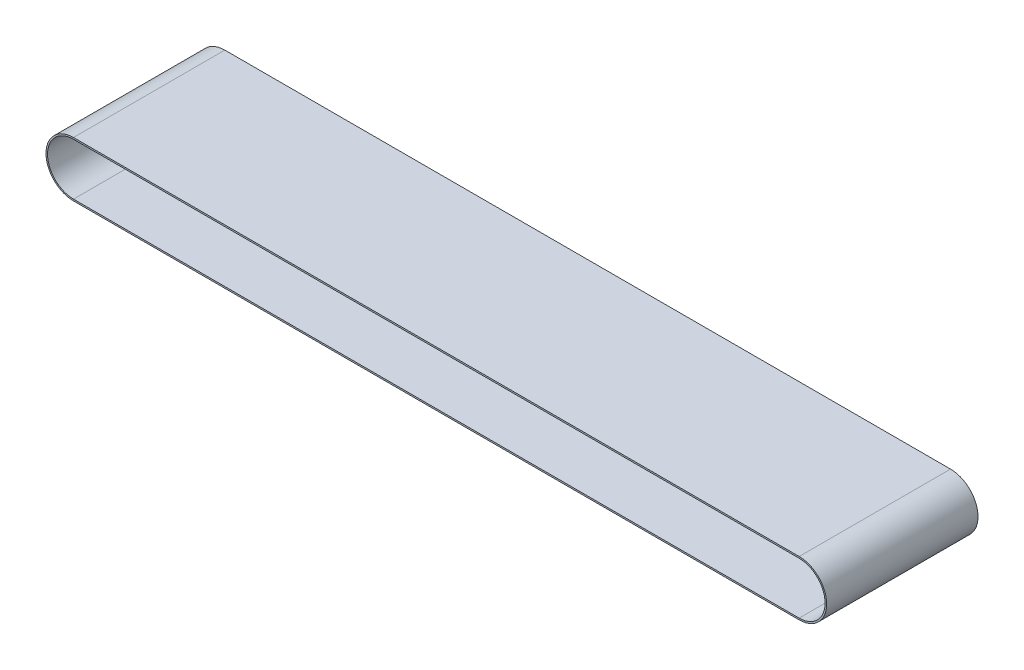
ISO-10303-21;
HEADER;
FILE_DESCRIPTION(('STEP AP214'),'2;1');
FILE_NAME('part.step','',(''),(''),'','','');
FILE_SCHEMA(('AUTOMOTIVE_DESIGN { 1 0 10303 214 1 1 1 1 }'));
ENDSEC;
DATA;
#1=APPLICATION_CONTEXT('core data for automotive mechanical design processes');
#2=APPLICATION_PROTOCOL_DEFINITION('international standard','automotive_design',2000,#1);
#3=PRODUCT_CONTEXT('',#1,'mechanical');
#4=PRODUCT('Part','Part','',(#3));
#5=PRODUCT_RELATED_PRODUCT_CATEGORY('part','',(#4));
#6=PRODUCT_DEFINITION_FORMATION('','',#4);
#7=PRODUCT_DEFINITION_CONTEXT('part definition',#1,'design');
#8=PRODUCT_DEFINITION('design','',#6,#7);
#9=PRODUCT_DEFINITION_SHAPE('','',#8);
#10=(LENGTH_UNIT() NAMED_UNIT(*) SI_UNIT(.MILLI.,.METRE.));
#11=(NAMED_UNIT(*) PLANE_ANGLE_UNIT() SI_UNIT($,.RADIAN.));
#12=(NAMED_UNIT(*) SI_UNIT($,.STERADIAN.) SOLID_ANGLE_UNIT());
#13=UNCERTAINTY_MEASURE_WITH_UNIT(LENGTH_MEASURE(1.E-05),#10,'distance_accuracy_value','');
#14=(GEOMETRIC_REPRESENTATION_CONTEXT(3) GLOBAL_UNCERTAINTY_ASSIGNED_CONTEXT((#13)) GLOBAL_UNIT_ASSIGNED_CONTEXT((#10,
#11,#12)) REPRESENTATION_CONTEXT('',''));
#15=CARTESIAN_POINT('',(0.,0.,0.));
#16=DIRECTION('',(0.,0.,1.));
#17=DIRECTION('',(1.,0.,0.));
#18=AXIS2_PLACEMENT_3D('',#15,#16,#17);
#19=CARTESIAN_POINT('',(0.,0.,73.));
#20=DIRECTION('',(0.,0.,1.));
#21=DIRECTION('',(1.,0.,0.));
#22=AXIS2_PLACEMENT_3D('',#19,#20,#21);
#23=PLANE('',#22);
#24=CARTESIAN_POINT('',(0.,0.,73.));
#25=DIRECTION('',(0.,0.,1.));
#26=DIRECTION('',(1.,0.,0.));
#27=AXIS2_PLACEMENT_3D('',#24,#25,#26);
#28=CIRCLE('',#27,26.5);
#29=CARTESIAN_POINT('',(0.,26.5,73.));
#30=VERTEX_POINT('',#29);
#31=CARTESIAN_POINT('',(0.,-26.5,73.));
#32=VERTEX_POINT('',#31);
#33=EDGE_CURVE('E158',#30,#32,#28,.T.);
#34=ORIENTED_EDGE('',*,*,#33,.T.);
#35=DIRECTION('',(1.,0.,0.));
#36=VECTOR('',#35,1.);
#37=CARTESIAN_POINT('',(0.,-26.5,73.));
#38=LINE('',#37,#36);
#39=CARTESIAN_POINT('',(700.,-26.5,73.));
#40=VERTEX_POINT('',#39);
#41=EDGE_CURVE('E162',#32,#40,#38,.T.);
#42=ORIENTED_EDGE('',*,*,#41,.T.);
#43=CARTESIAN_POINT('',(700.,0.,73.));
#44=DIRECTION('',(0.,0.,1.));
#45=DIRECTION('',(1.,0.,0.));
#46=AXIS2_PLACEMENT_3D('',#43,#44,#45);
#47=CIRCLE('',#46,26.5);
#48=CARTESIAN_POINT('',(700.,26.5,73.));
#49=VERTEX_POINT('',#48);
#50=EDGE_CURVE('E166',#40,#49,#47,.T.);
#51=ORIENTED_EDGE('',*,*,#50,.T.);
#52=DIRECTION('',(-1.,0.,0.));
#53=VECTOR('',#52,1.);
#54=CARTESIAN_POINT('',(0.,26.5,73.));
#55=LINE('',#54,#53);
#56=EDGE_CURVE('E169',#49,#30,#55,.T.);
#57=ORIENTED_EDGE('',*,*,#56,.T.);
#58=EDGE_LOOP('',(#34,#42,#51,#57));
#59=FACE_BOUND('',#58,.T.);
#60=DIRECTION('',(1.,0.,0.));
#61=VECTOR('',#60,1.);
#62=CARTESIAN_POINT('',(0.,-25.,73.));
#63=LINE('',#62,#61);
#64=CARTESIAN_POINT('',(0.,-25.,73.));
#65=VERTEX_POINT('',#64);
#66=CARTESIAN_POINT('',(700.,-25.,73.));
#67=VERTEX_POINT('',#66);
#68=EDGE_CURVE('E119',#65,#67,#63,.T.);
#69=ORIENTED_EDGE('',*,*,#68,.F.);
#70=CARTESIAN_POINT('',(0.,0.,73.));
#71=DIRECTION('',(0.,0.,1.));
#72=DIRECTION('',(1.,0.,0.));
#73=AXIS2_PLACEMENT_3D('',#70,#71,#72);
#74=CIRCLE('',#73,25.);
#75=CARTESIAN_POINT('',(0.,25.,73.));
#76=VERTEX_POINT('',#75);
#77=EDGE_CURVE('E110',#76,#65,#74,.T.);
#78=ORIENTED_EDGE('',*,*,#77,.F.);
#79=DIRECTION('',(-1.,0.,0.));
#80=VECTOR('',#79,1.);
#81=CARTESIAN_POINT('',(0.,25.,73.));
#82=LINE('',#81,#80);
#83=CARTESIAN_POINT('',(700.,25.,73.));
#84=VERTEX_POINT('',#83);
#85=EDGE_CURVE('E136',#84,#76,#82,.T.);
#86=ORIENTED_EDGE('',*,*,#85,.F.);
#87=CARTESIAN_POINT('',(700.,0.,73.));
#88=DIRECTION('',(0.,0.,1.));
#89=DIRECTION('',(1.,0.,0.));
#90=AXIS2_PLACEMENT_3D('',#87,#88,#89);
#91=CIRCLE('',#90,25.);
#92=EDGE_CURVE('E132',#67,#84,#91,.T.);
#93=ORIENTED_EDGE('',*,*,#92,.F.);
#94=EDGE_LOOP('',(#69,#78,#86,#93));
#95=FACE_BOUND('',#94,.T.);
#96=ADVANCED_FACE('F44',(#59,#95),#23,.T.);
#97=CARTESIAN_POINT('',(0.,0.,-73.));
#98=DIRECTION('',(0.,0.,1.));
#99=DIRECTION('',(1.,0.,0.));
#100=AXIS2_PLACEMENT_3D('',#97,#98,#99);
#101=PLANE('',#100);
#102=CARTESIAN_POINT('',(0.,0.,-73.));
#103=DIRECTION('',(0.,0.,1.));
#104=DIRECTION('',(1.,0.,0.));
#105=AXIS2_PLACEMENT_3D('',#102,#103,#104);
#106=CIRCLE('',#105,26.5);
#107=CARTESIAN_POINT('',(0.,26.5,-73.));
#108=VERTEX_POINT('',#107);
#109=CARTESIAN_POINT('',(0.,-26.5,-73.));
#110=VERTEX_POINT('',#109);
#111=EDGE_CURVE('E128',#108,#110,#106,.T.);
#112=ORIENTED_EDGE('',*,*,#111,.F.);
#113=DIRECTION('',(-1.,0.,0.));
#114=VECTOR('',#113,1.);
#115=CARTESIAN_POINT('',(0.,26.5,-73.));
#116=LINE('',#115,#114);
#117=CARTESIAN_POINT('',(700.,26.5,-73.));
#118=VERTEX_POINT('',#117);
#119=EDGE_CURVE('E163',#118,#108,#116,.T.);
#120=ORIENTED_EDGE('',*,*,#119,.F.);
#121=CARTESIAN_POINT('',(700.,0.,-73.));
#122=DIRECTION('',(0.,0.,1.));
#123=DIRECTION('',(1.,0.,0.));
#124=AXIS2_PLACEMENT_3D('',#121,#122,#123);
#125=CIRCLE('',#124,26.5);
#126=CARTESIAN_POINT('',(700.,-26.5,-73.));
#127=VERTEX_POINT('',#126);
#128=EDGE_CURVE('E179',#127,#118,#125,.T.);
#129=ORIENTED_EDGE('',*,*,#128,.F.);
#130=DIRECTION('',(1.,0.,0.));
#131=VECTOR('',#130,1.);
#132=CARTESIAN_POINT('',(0.,-26.5,-73.));
#133=LINE('',#132,#131);
#134=EDGE_CURVE('E176',#110,#127,#133,.T.);
#135=ORIENTED_EDGE('',*,*,#134,.F.);
#136=EDGE_LOOP('',(#112,#120,#129,#135));
#137=FACE_BOUND('',#136,.T.);
#138=CARTESIAN_POINT('',(0.,0.,-73.));
#139=DIRECTION('',(0.,0.,1.));
#140=DIRECTION('',(1.,0.,0.));
#141=AXIS2_PLACEMENT_3D('',#138,#139,#140);
#142=CIRCLE('',#141,25.);
#143=CARTESIAN_POINT('',(0.,25.,-73.));
#144=VERTEX_POINT('',#143);
#145=CARTESIAN_POINT('',(0.,-25.,-73.));
#146=VERTEX_POINT('',#145);
#147=EDGE_CURVE('E68',#144,#146,#142,.T.);
#148=ORIENTED_EDGE('',*,*,#147,.T.);
#149=DIRECTION('',(1.,0.,0.));
#150=VECTOR('',#149,1.);
#151=CARTESIAN_POINT('',(0.,-25.,-73.));
#152=LINE('',#151,#150);
#153=CARTESIAN_POINT('',(700.,-25.,-73.));
#154=VERTEX_POINT('',#153);
#155=EDGE_CURVE('E126',#146,#154,#152,.T.);
#156=ORIENTED_EDGE('',*,*,#155,.T.);
#157=CARTESIAN_POINT('',(700.,0.,-73.));
#158=DIRECTION('',(0.,0.,1.));
#159=DIRECTION('',(1.,0.,0.));
#160=AXIS2_PLACEMENT_3D('',#157,#158,#159);
#161=CIRCLE('',#160,25.);
#162=CARTESIAN_POINT('',(700.,25.,-73.));
#163=VERTEX_POINT('',#162);
#164=EDGE_CURVE('E145',#154,#163,#161,.T.);
#165=ORIENTED_EDGE('',*,*,#164,.T.);
#166=DIRECTION('',(-1.,0.,0.));
#167=VECTOR('',#166,1.);
#168=CARTESIAN_POINT('',(0.,25.,-73.));
#169=LINE('',#168,#167);
#170=EDGE_CURVE('E120',#163,#144,#169,.T.);
#171=ORIENTED_EDGE('',*,*,#170,.T.);
#172=EDGE_LOOP('',(#148,#156,#165,#171));
#173=FACE_BOUND('',#172,.T.);
#174=ADVANCED_FACE('F202',(#137,#173),#101,.F.);
#175=CARTESIAN_POINT('',(0.,0.,73.));
#176=DIRECTION('',(0.,0.,-1.));
#177=DIRECTION('',(-1.,0.,0.));
#178=AXIS2_PLACEMENT_3D('',#175,#176,#177);
#179=CYLINDRICAL_SURFACE('',#178,26.5);
#180=ORIENTED_EDGE('',*,*,#111,.T.);
#181=DIRECTION('',(0.,0.,-1.));
#182=VECTOR('',#181,1.);
#183=CARTESIAN_POINT('',(0.,-26.5,73.));
#184=LINE('',#183,#182);
#185=EDGE_CURVE('E11',#32,#110,#184,.T.);
#186=ORIENTED_EDGE('',*,*,#185,.F.);
#187=ORIENTED_EDGE('',*,*,#33,.F.);
#188=DIRECTION('',(0.,0.,-1.));
#189=VECTOR('',#188,1.);
#190=CARTESIAN_POINT('',(0.,26.5,73.));
#191=LINE('',#190,#189);
#192=EDGE_CURVE('E172',#30,#108,#191,.T.);
#193=ORIENTED_EDGE('',*,*,#192,.T.);
#194=EDGE_LOOP('',(#180,#186,#187,#193));
#195=FACE_BOUND('',#194,.T.);
#196=ADVANCED_FACE('F46',(#195),#179,.T.);
#197=CARTESIAN_POINT('',(0.,-26.5,73.));
#198=DIRECTION('',(0.,1.,0.));
#199=DIRECTION('',(0.,0.,1.));
#200=AXIS2_PLACEMENT_3D('',#197,#198,#199);
#201=PLANE('',#200);
#202=ORIENTED_EDGE('',*,*,#134,.T.);
#203=DIRECTION('',(0.,0.,-1.));
#204=VECTOR('',#203,1.);
#205=CARTESIAN_POINT('',(700.,-26.5,73.));
#206=LINE('',#205,#204);
#207=EDGE_CURVE('E53',#40,#127,#206,.T.);
#208=ORIENTED_EDGE('',*,*,#207,.F.);
#209=ORIENTED_EDGE('',*,*,#41,.F.);
#210=ORIENTED_EDGE('',*,*,#185,.T.);
#211=EDGE_LOOP('',(#202,#208,#209,#210));
#212=FACE_BOUND('',#211,.T.);
#213=ADVANCED_FACE('F212',(#212),#201,.F.);
#214=CARTESIAN_POINT('',(700.,0.,73.));
#215=DIRECTION('',(0.,0.,-1.));
#216=DIRECTION('',(-1.,0.,0.));
#217=AXIS2_PLACEMENT_3D('',#214,#215,#216);
#218=CYLINDRICAL_SURFACE('',#217,26.5);
#219=ORIENTED_EDGE('',*,*,#128,.T.);
#220=DIRECTION('',(0.,0.,-1.));
#221=VECTOR('',#220,1.);
#222=CARTESIAN_POINT('',(700.,26.5,73.));
#223=LINE('',#222,#221);
#224=EDGE_CURVE('E187',#49,#118,#223,.T.);
#225=ORIENTED_EDGE('',*,*,#224,.F.);
#226=ORIENTED_EDGE('',*,*,#50,.F.);
#227=ORIENTED_EDGE('',*,*,#207,.T.);
#228=EDGE_LOOP('',(#219,#225,#226,#227));
#229=FACE_BOUND('',#228,.T.);
#230=ADVANCED_FACE('F196',(#229),#218,.T.);
#231=CARTESIAN_POINT('',(0.,26.5,73.));
#232=DIRECTION('',(0.,-1.,0.));
#233=DIRECTION('',(0.,0.,-1.));
#234=AXIS2_PLACEMENT_3D('',#231,#232,#233);
#235=PLANE('',#234);
#236=ORIENTED_EDGE('',*,*,#119,.T.);
#237=ORIENTED_EDGE('',*,*,#192,.F.);
#238=ORIENTED_EDGE('',*,*,#56,.F.);
#239=ORIENTED_EDGE('',*,*,#224,.T.);
#240=EDGE_LOOP('',(#236,#237,#238,#239));
#241=FACE_BOUND('',#240,.T.);
#242=ADVANCED_FACE('F206',(#241),#235,.F.);
#243=CARTESIAN_POINT('',(0.,0.,73.));
#244=DIRECTION('',(0.,0.,-1.));
#245=DIRECTION('',(-1.,0.,0.));
#246=AXIS2_PLACEMENT_3D('',#243,#244,#245);
#247=CYLINDRICAL_SURFACE('',#246,25.);
#248=ORIENTED_EDGE('',*,*,#147,.F.);
#249=DIRECTION('',(0.,0.,-1.));
#250=VECTOR('',#249,1.);
#251=CARTESIAN_POINT('',(0.,25.,73.));
#252=LINE('',#251,#250);
#253=EDGE_CURVE('E114',#76,#144,#252,.T.);
#254=ORIENTED_EDGE('',*,*,#253,.F.);
#255=ORIENTED_EDGE('',*,*,#77,.T.);
#256=DIRECTION('',(0.,0.,-1.));
#257=VECTOR('',#256,1.);
#258=CARTESIAN_POINT('',(0.,-25.,73.));
#259=LINE('',#258,#257);
#260=EDGE_CURVE('E113',#65,#146,#259,.T.);
#261=ORIENTED_EDGE('',*,*,#260,.T.);
#262=EDGE_LOOP('',(#248,#254,#255,#261));
#263=FACE_BOUND('',#262,.T.);
#264=ADVANCED_FACE('F112',(#263),#247,.F.);
#265=CARTESIAN_POINT('',(0.,-25.,73.));
#266=DIRECTION('',(0.,1.,0.));
#267=DIRECTION('',(0.,0.,1.));
#268=AXIS2_PLACEMENT_3D('',#265,#266,#267);
#269=PLANE('',#268);
#270=ORIENTED_EDGE('',*,*,#155,.F.);
#271=ORIENTED_EDGE('',*,*,#260,.F.);
#272=ORIENTED_EDGE('',*,*,#68,.T.);
#273=DIRECTION('',(0.,0.,-1.));
#274=VECTOR('',#273,1.);
#275=CARTESIAN_POINT('',(700.,-25.,73.));
#276=LINE('',#275,#274);
#277=EDGE_CURVE('E129',#67,#154,#276,.T.);
#278=ORIENTED_EDGE('',*,*,#277,.T.);
#279=EDGE_LOOP('',(#270,#271,#272,#278));
#280=FACE_BOUND('',#279,.T.);
#281=ADVANCED_FACE('F123',(#280),#269,.T.);
#282=CARTESIAN_POINT('',(700.,0.,73.));
#283=DIRECTION('',(0.,0.,-1.));
#284=DIRECTION('',(-1.,0.,0.));
#285=AXIS2_PLACEMENT_3D('',#282,#283,#284);
#286=CYLINDRICAL_SURFACE('',#285,25.);
#287=ORIENTED_EDGE('',*,*,#164,.F.);
#288=ORIENTED_EDGE('',*,*,#277,.F.);
#289=ORIENTED_EDGE('',*,*,#92,.T.);
#290=DIRECTION('',(0.,0.,-1.));
#291=VECTOR('',#290,1.);
#292=CARTESIAN_POINT('',(700.,25.,73.));
#293=LINE('',#292,#291);
#294=EDGE_CURVE('E60',#84,#163,#293,.T.);
#295=ORIENTED_EDGE('',*,*,#294,.T.);
#296=EDGE_LOOP('',(#287,#288,#289,#295));
#297=FACE_BOUND('',#296,.T.);
#298=ADVANCED_FACE('F235',(#297),#286,.F.);
#299=CARTESIAN_POINT('',(0.,25.,73.));
#300=DIRECTION('',(0.,-1.,0.));
#301=DIRECTION('',(0.,0.,-1.));
#302=AXIS2_PLACEMENT_3D('',#299,#300,#301);
#303=PLANE('',#302);
#304=ORIENTED_EDGE('',*,*,#170,.F.);
#305=ORIENTED_EDGE('',*,*,#294,.F.);
#306=ORIENTED_EDGE('',*,*,#85,.T.);
#307=ORIENTED_EDGE('',*,*,#253,.T.);
#308=EDGE_LOOP('',(#304,#305,#306,#307));
#309=FACE_BOUND('',#308,.T.);
#310=ADVANCED_FACE('F239',(#309),#303,.T.);
#311=CLOSED_SHELL('',(#96,#174,#196,#213,#230,#242,#264,#281,#298,#310));
#312=MANIFOLD_SOLID_BREP('B2',#311);
#313=ADVANCED_BREP_SHAPE_REPRESENTATION('',(#18,#312),#14);
#314=SHAPE_DEFINITION_REPRESENTATION(#9,#313);
ENDSEC;
END-ISO-10303-21;
